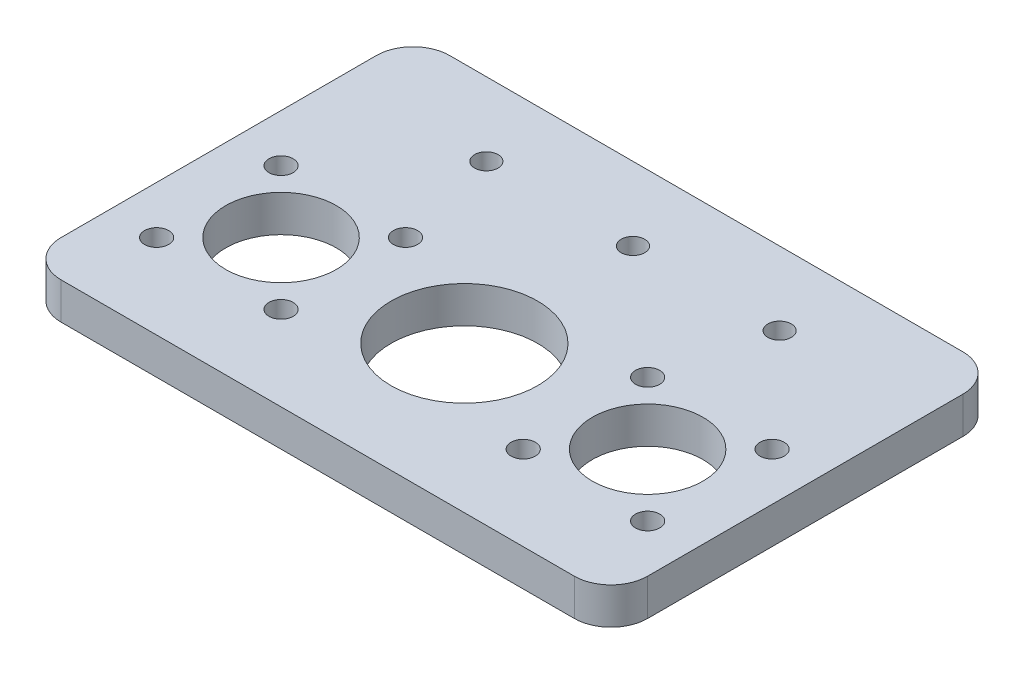
ISO-10303-21;
HEADER;
FILE_DESCRIPTION(('STEP AP214'),'2;1');
FILE_NAME('part.step','',(''),(''),'','','');
FILE_SCHEMA(('AUTOMOTIVE_DESIGN { 1 0 10303 214 1 1 1 1 }'));
ENDSEC;
DATA;
#1=APPLICATION_CONTEXT('core data for automotive mechanical design processes');
#2=APPLICATION_PROTOCOL_DEFINITION('international standard','automotive_design',2000,#1);
#3=PRODUCT_CONTEXT('',#1,'mechanical');
#4=PRODUCT('Part','Part','',(#3));
#5=PRODUCT_RELATED_PRODUCT_CATEGORY('part','',(#4));
#6=PRODUCT_DEFINITION_FORMATION('','',#4);
#7=PRODUCT_DEFINITION_CONTEXT('part definition',#1,'design');
#8=PRODUCT_DEFINITION('design','',#6,#7);
#9=PRODUCT_DEFINITION_SHAPE('','',#8);
#10=(LENGTH_UNIT() NAMED_UNIT(*) SI_UNIT(.MILLI.,.METRE.));
#11=(NAMED_UNIT(*) PLANE_ANGLE_UNIT() SI_UNIT($,.RADIAN.));
#12=(NAMED_UNIT(*) SI_UNIT($,.STERADIAN.) SOLID_ANGLE_UNIT());
#13=UNCERTAINTY_MEASURE_WITH_UNIT(LENGTH_MEASURE(1.E-05),#10,'distance_accuracy_value','');
#14=(GEOMETRIC_REPRESENTATION_CONTEXT(3) GLOBAL_UNCERTAINTY_ASSIGNED_CONTEXT((#13)) GLOBAL_UNIT_ASSIGNED_CONTEXT((#10,
#11,#12)) REPRESENTATION_CONTEXT('',''));
#15=CARTESIAN_POINT('',(0.,0.,0.));
#16=DIRECTION('',(0.,0.,1.));
#17=DIRECTION('',(1.,0.,0.));
#18=AXIS2_PLACEMENT_3D('',#15,#16,#17);
#19=CARTESIAN_POINT('',(0.,5.,-33.));
#20=DIRECTION('',(0.,0.,-1.));
#21=DIRECTION('',(-1.,0.,0.));
#22=AXIS2_PLACEMENT_3D('',#19,#20,#21);
#23=PLANE('',#22);
#24=DIRECTION('',(1.,0.,0.));
#25=VECTOR('',#24,1.);
#26=CARTESIAN_POINT('',(0.,0.,-33.));
#27=LINE('',#26,#25);
#28=CARTESIAN_POINT('',(-35.,0.,-33.));
#29=VERTEX_POINT('',#28);
#30=CARTESIAN_POINT('',(35.,0.,-33.));
#31=VERTEX_POINT('',#30);
#32=EDGE_CURVE('E173',#29,#31,#27,.T.);
#33=ORIENTED_EDGE('',*,*,#32,.F.);
#34=DIRECTION('',(0.,-1.,0.));
#35=VECTOR('',#34,1.);
#36=CARTESIAN_POINT('',(-35.,5.,-33.));
#37=LINE('',#36,#35);
#38=CARTESIAN_POINT('',(-35.,5.,-33.));
#39=VERTEX_POINT('',#38);
#40=EDGE_CURVE('E11',#39,#29,#37,.T.);
#41=ORIENTED_EDGE('',*,*,#40,.F.);
#42=DIRECTION('',(1.,0.,0.));
#43=VECTOR('',#42,1.);
#44=CARTESIAN_POINT('',(0.,5.,-33.));
#45=LINE('',#44,#43);
#46=CARTESIAN_POINT('',(35.,5.,-33.));
#47=VERTEX_POINT('',#46);
#48=EDGE_CURVE('E495',#39,#47,#45,.T.);
#49=ORIENTED_EDGE('',*,*,#48,.T.);
#50=DIRECTION('',(0.,-1.,0.));
#51=VECTOR('',#50,1.);
#52=CARTESIAN_POINT('',(35.,5.,-33.));
#53=LINE('',#52,#51);
#54=EDGE_CURVE('E88',#47,#31,#53,.T.);
#55=ORIENTED_EDGE('',*,*,#54,.T.);
#56=EDGE_LOOP('',(#33,#41,#49,#55));
#57=FACE_BOUND('',#56,.T.);
#58=ADVANCED_FACE('F37',(#57),#23,.T.);
#59=CARTESIAN_POINT('',(-35.,5.,-28.));
#60=DIRECTION('',(0.,-1.,0.));
#61=DIRECTION('',(0.,0.,-1.));
#62=AXIS2_PLACEMENT_3D('',#59,#60,#61);
#63=CYLINDRICAL_SURFACE('',#62,5.);
#64=CARTESIAN_POINT('',(-35.,0.,-28.));
#65=DIRECTION('',(0.,1.,0.));
#66=DIRECTION('',(0.,0.,1.));
#67=AXIS2_PLACEMENT_3D('',#64,#65,#66);
#68=CIRCLE('',#67,5.);
#69=CARTESIAN_POINT('',(-40.,0.,-28.));
#70=VERTEX_POINT('',#69);
#71=EDGE_CURVE('E176',#29,#70,#68,.T.);
#72=ORIENTED_EDGE('',*,*,#71,.T.);
#73=DIRECTION('',(0.,-1.,0.));
#74=VECTOR('',#73,1.);
#75=CARTESIAN_POINT('',(-40.,5.,-28.));
#76=LINE('',#75,#74);
#77=CARTESIAN_POINT('',(-40.,5.,-28.));
#78=VERTEX_POINT('',#77);
#79=EDGE_CURVE('E46',#78,#70,#76,.T.);
#80=ORIENTED_EDGE('',*,*,#79,.F.);
#81=CARTESIAN_POINT('',(-35.,5.,-28.));
#82=DIRECTION('',(0.,1.,0.));
#83=DIRECTION('',(0.,0.,1.));
#84=AXIS2_PLACEMENT_3D('',#81,#82,#83);
#85=CIRCLE('',#84,5.);
#86=EDGE_CURVE('E491',#39,#78,#85,.T.);
#87=ORIENTED_EDGE('',*,*,#86,.F.);
#88=ORIENTED_EDGE('',*,*,#40,.T.);
#89=EDGE_LOOP('',(#72,#80,#87,#88));
#90=FACE_BOUND('',#89,.T.);
#91=ADVANCED_FACE('F212',(#90),#63,.T.);
#92=CARTESIAN_POINT('',(-40.,5.,0.));
#93=DIRECTION('',(1.,0.,0.));
#94=DIRECTION('',(0.,0.,-1.));
#95=AXIS2_PLACEMENT_3D('',#92,#93,#94);
#96=PLANE('',#95);
#97=DIRECTION('',(0.,0.,1.));
#98=VECTOR('',#97,1.);
#99=CARTESIAN_POINT('',(-40.,0.,0.));
#100=LINE('',#99,#98);
#101=CARTESIAN_POINT('',(-40.,0.,15.));
#102=VERTEX_POINT('',#101);
#103=EDGE_CURVE('E179',#70,#102,#100,.T.);
#104=ORIENTED_EDGE('',*,*,#103,.T.);
#105=DIRECTION('',(0.,-1.,0.));
#106=VECTOR('',#105,1.);
#107=CARTESIAN_POINT('',(-40.,5.,15.));
#108=LINE('',#107,#106);
#109=CARTESIAN_POINT('',(-40.,5.,15.));
#110=VERTEX_POINT('',#109);
#111=EDGE_CURVE('E200',#110,#102,#108,.T.);
#112=ORIENTED_EDGE('',*,*,#111,.F.);
#113=DIRECTION('',(0.,0.,1.));
#114=VECTOR('',#113,1.);
#115=CARTESIAN_POINT('',(-40.,5.,0.));
#116=LINE('',#115,#114);
#117=EDGE_CURVE('E208',#78,#110,#116,.T.);
#118=ORIENTED_EDGE('',*,*,#117,.F.);
#119=ORIENTED_EDGE('',*,*,#79,.T.);
#120=EDGE_LOOP('',(#104,#112,#118,#119));
#121=FACE_BOUND('',#120,.T.);
#122=ADVANCED_FACE('F205',(#121),#96,.F.);
#123=CARTESIAN_POINT('',(-35.,5.,15.));
#124=DIRECTION('',(0.,-1.,0.));
#125=DIRECTION('',(0.,0.,-1.));
#126=AXIS2_PLACEMENT_3D('',#123,#124,#125);
#127=CYLINDRICAL_SURFACE('',#126,5.);
#128=CARTESIAN_POINT('',(-35.,0.,15.));
#129=DIRECTION('',(0.,1.,0.));
#130=DIRECTION('',(0.,0.,1.));
#131=AXIS2_PLACEMENT_3D('',#128,#129,#130);
#132=CIRCLE('',#131,5.);
#133=CARTESIAN_POINT('',(-35.,0.,20.));
#134=VERTEX_POINT('',#133);
#135=EDGE_CURVE('E182',#102,#134,#132,.T.);
#136=ORIENTED_EDGE('',*,*,#135,.T.);
#137=DIRECTION('',(0.,-1.,0.));
#138=VECTOR('',#137,1.);
#139=CARTESIAN_POINT('',(-35.,5.,20.));
#140=LINE('',#139,#138);
#141=CARTESIAN_POINT('',(-35.,5.,20.));
#142=VERTEX_POINT('',#141);
#143=EDGE_CURVE('E197',#142,#134,#140,.T.);
#144=ORIENTED_EDGE('',*,*,#143,.F.);
#145=CARTESIAN_POINT('',(-35.,5.,15.));
#146=DIRECTION('',(0.,1.,0.));
#147=DIRECTION('',(0.,0.,1.));
#148=AXIS2_PLACEMENT_3D('',#145,#146,#147);
#149=CIRCLE('',#148,5.);
#150=EDGE_CURVE('E489',#110,#142,#149,.T.);
#151=ORIENTED_EDGE('',*,*,#150,.F.);
#152=ORIENTED_EDGE('',*,*,#111,.T.);
#153=EDGE_LOOP('',(#136,#144,#151,#152));
#154=FACE_BOUND('',#153,.T.);
#155=ADVANCED_FACE('F339',(#154),#127,.T.);
#156=CARTESIAN_POINT('',(0.,5.,20.));
#157=DIRECTION('',(0.,0.,-1.));
#158=DIRECTION('',(-1.,0.,0.));
#159=AXIS2_PLACEMENT_3D('',#156,#157,#158);
#160=PLANE('',#159);
#161=DIRECTION('',(1.,0.,0.));
#162=VECTOR('',#161,1.);
#163=CARTESIAN_POINT('',(0.,0.,20.));
#164=LINE('',#163,#162);
#165=CARTESIAN_POINT('',(35.,0.,20.));
#166=VERTEX_POINT('',#165);
#167=EDGE_CURVE('E185',#134,#166,#164,.T.);
#168=ORIENTED_EDGE('',*,*,#167,.T.);
#169=DIRECTION('',(0.,-1.,0.));
#170=VECTOR('',#169,1.);
#171=CARTESIAN_POINT('',(35.,5.,20.));
#172=LINE('',#171,#170);
#173=CARTESIAN_POINT('',(35.,5.,20.));
#174=VERTEX_POINT('',#173);
#175=EDGE_CURVE('E124',#174,#166,#172,.T.);
#176=ORIENTED_EDGE('',*,*,#175,.F.);
#177=DIRECTION('',(1.,0.,0.));
#178=VECTOR('',#177,1.);
#179=CARTESIAN_POINT('',(0.,5.,20.));
#180=LINE('',#179,#178);
#181=EDGE_CURVE('E112',#142,#174,#180,.T.);
#182=ORIENTED_EDGE('',*,*,#181,.F.);
#183=ORIENTED_EDGE('',*,*,#143,.T.);
#184=EDGE_LOOP('',(#168,#176,#182,#183));
#185=FACE_BOUND('',#184,.T.);
#186=ADVANCED_FACE('F336',(#185),#160,.F.);
#187=CARTESIAN_POINT('',(35.,5.,15.));
#188=DIRECTION('',(0.,-1.,0.));
#189=DIRECTION('',(0.,0.,-1.));
#190=AXIS2_PLACEMENT_3D('',#187,#188,#189);
#191=CYLINDRICAL_SURFACE('',#190,5.);
#192=CARTESIAN_POINT('',(35.,0.,15.));
#193=DIRECTION('',(0.,1.,0.));
#194=DIRECTION('',(0.,0.,1.));
#195=AXIS2_PLACEMENT_3D('',#192,#193,#194);
#196=CIRCLE('',#195,5.);
#197=CARTESIAN_POINT('',(40.,0.,15.));
#198=VERTEX_POINT('',#197);
#199=EDGE_CURVE('E120',#166,#198,#196,.T.);
#200=ORIENTED_EDGE('',*,*,#199,.T.);
#201=DIRECTION('',(0.,-1.,0.));
#202=VECTOR('',#201,1.);
#203=CARTESIAN_POINT('',(40.,5.,15.));
#204=LINE('',#203,#202);
#205=CARTESIAN_POINT('',(40.,5.,15.));
#206=VERTEX_POINT('',#205);
#207=EDGE_CURVE('E118',#206,#198,#204,.T.);
#208=ORIENTED_EDGE('',*,*,#207,.F.);
#209=CARTESIAN_POINT('',(35.,5.,15.));
#210=DIRECTION('',(0.,1.,0.));
#211=DIRECTION('',(0.,0.,1.));
#212=AXIS2_PLACEMENT_3D('',#209,#210,#211);
#213=CIRCLE('',#212,5.);
#214=EDGE_CURVE('E106',#174,#206,#213,.T.);
#215=ORIENTED_EDGE('',*,*,#214,.F.);
#216=ORIENTED_EDGE('',*,*,#175,.T.);
#217=EDGE_LOOP('',(#200,#208,#215,#216));
#218=FACE_BOUND('',#217,.T.);
#219=ADVANCED_FACE('F119',(#218),#191,.T.);
#220=CARTESIAN_POINT('',(40.,5.,0.));
#221=DIRECTION('',(1.,0.,0.));
#222=DIRECTION('',(0.,0.,-1.));
#223=AXIS2_PLACEMENT_3D('',#220,#221,#222);
#224=PLANE('',#223);
#225=DIRECTION('',(0.,0.,1.));
#226=VECTOR('',#225,1.);
#227=CARTESIAN_POINT('',(40.,0.,0.));
#228=LINE('',#227,#226);
#229=CARTESIAN_POINT('',(40.,0.,-28.));
#230=VERTEX_POINT('',#229);
#231=EDGE_CURVE('E189',#230,#198,#228,.T.);
#232=ORIENTED_EDGE('',*,*,#231,.F.);
#233=DIRECTION('',(0.,-1.,0.));
#234=VECTOR('',#233,1.);
#235=CARTESIAN_POINT('',(40.,5.,-28.));
#236=LINE('',#235,#234);
#237=CARTESIAN_POINT('',(40.,5.,-28.));
#238=VERTEX_POINT('',#237);
#239=EDGE_CURVE('E81',#238,#230,#236,.T.);
#240=ORIENTED_EDGE('',*,*,#239,.F.);
#241=DIRECTION('',(0.,0.,1.));
#242=VECTOR('',#241,1.);
#243=CARTESIAN_POINT('',(40.,5.,0.));
#244=LINE('',#243,#242);
#245=EDGE_CURVE('E110',#238,#206,#244,.T.);
#246=ORIENTED_EDGE('',*,*,#245,.T.);
#247=ORIENTED_EDGE('',*,*,#207,.T.);
#248=EDGE_LOOP('',(#232,#240,#246,#247));
#249=FACE_BOUND('',#248,.T.);
#250=ADVANCED_FACE('F126',(#249),#224,.T.);
#251=CARTESIAN_POINT('',(20.,5.,-23.));
#252=DIRECTION('',(0.,-1.,0.));
#253=DIRECTION('',(0.,0.,-1.));
#254=AXIS2_PLACEMENT_3D('',#251,#252,#253);
#255=CYLINDRICAL_SURFACE('',#254,1.6);
#256=CARTESIAN_POINT('',(20.,5.,-23.));
#257=DIRECTION('',(0.,1.,0.));
#258=DIRECTION('',(0.,0.,1.));
#259=AXIS2_PLACEMENT_3D('',#256,#257,#258);
#260=CIRCLE('',#259,1.6);
#261=CARTESIAN_POINT('',(20.,5.,-21.4));
#262=VERTEX_POINT('',#261);
#263=EDGE_CURVE('E497',#262,#262,#260,.T.);
#264=ORIENTED_EDGE('',*,*,#263,.T.);
#265=EDGE_LOOP('',(#264));
#266=FACE_BOUND('',#265,.T.);
#267=CARTESIAN_POINT('',(20.,0.,-23.));
#268=DIRECTION('',(0.,1.,0.));
#269=DIRECTION('',(0.,0.,1.));
#270=AXIS2_PLACEMENT_3D('',#267,#268,#269);
#271=CIRCLE('',#270,1.6);
#272=CARTESIAN_POINT('',(20.,0.,-21.4));
#273=VERTEX_POINT('',#272);
#274=EDGE_CURVE('E170',#273,#273,#271,.T.);
#275=ORIENTED_EDGE('',*,*,#274,.F.);
#276=EDGE_LOOP('',(#275));
#277=FACE_BOUND('',#276,.T.);
#278=ADVANCED_FACE('F223',(#266,#277),#255,.F.);
#279=CARTESIAN_POINT('',(0.,5.,-23.));
#280=DIRECTION('',(0.,-1.,0.));
#281=DIRECTION('',(0.,0.,-1.));
#282=AXIS2_PLACEMENT_3D('',#279,#280,#281);
#283=CYLINDRICAL_SURFACE('',#282,1.6);
#284=CARTESIAN_POINT('',(0.,5.,-23.));
#285=DIRECTION('',(0.,1.,0.));
#286=DIRECTION('',(0.,0.,1.));
#287=AXIS2_PLACEMENT_3D('',#284,#285,#286);
#288=CIRCLE('',#287,1.6);
#289=CARTESIAN_POINT('',(0.,5.,-21.4));
#290=VERTEX_POINT('',#289);
#291=EDGE_CURVE('E500',#290,#290,#288,.T.);
#292=ORIENTED_EDGE('',*,*,#291,.T.);
#293=EDGE_LOOP('',(#292));
#294=FACE_BOUND('',#293,.T.);
#295=CARTESIAN_POINT('',(0.,0.,-23.));
#296=DIRECTION('',(0.,1.,0.));
#297=DIRECTION('',(0.,0.,1.));
#298=AXIS2_PLACEMENT_3D('',#295,#296,#297);
#299=CIRCLE('',#298,1.6);
#300=CARTESIAN_POINT('',(0.,0.,-21.4));
#301=VERTEX_POINT('',#300);
#302=EDGE_CURVE('E167',#301,#301,#299,.T.);
#303=ORIENTED_EDGE('',*,*,#302,.F.);
#304=EDGE_LOOP('',(#303));
#305=FACE_BOUND('',#304,.T.);
#306=ADVANCED_FACE('F226',(#294,#305),#283,.F.);
#307=CARTESIAN_POINT('',(-20.,5.,-23.));
#308=DIRECTION('',(0.,-1.,0.));
#309=DIRECTION('',(0.,0.,-1.));
#310=AXIS2_PLACEMENT_3D('',#307,#308,#309);
#311=CYLINDRICAL_SURFACE('',#310,1.6);
#312=CARTESIAN_POINT('',(-20.,5.,-23.));
#313=DIRECTION('',(0.,1.,0.));
#314=DIRECTION('',(0.,0.,1.));
#315=AXIS2_PLACEMENT_3D('',#312,#313,#314);
#316=CIRCLE('',#315,1.6);
#317=CARTESIAN_POINT('',(-20.,5.,-21.4));
#318=VERTEX_POINT('',#317);
#319=EDGE_CURVE('E503',#318,#318,#316,.T.);
#320=ORIENTED_EDGE('',*,*,#319,.T.);
#321=EDGE_LOOP('',(#320));
#322=FACE_BOUND('',#321,.T.);
#323=CARTESIAN_POINT('',(-20.,0.,-23.));
#324=DIRECTION('',(0.,1.,0.));
#325=DIRECTION('',(0.,0.,1.));
#326=AXIS2_PLACEMENT_3D('',#323,#324,#325);
#327=CIRCLE('',#326,1.6);
#328=CARTESIAN_POINT('',(-20.,0.,-21.4));
#329=VERTEX_POINT('',#328);
#330=EDGE_CURVE('E164',#329,#329,#327,.T.);
#331=ORIENTED_EDGE('',*,*,#330,.F.);
#332=EDGE_LOOP('',(#331));
#333=FACE_BOUND('',#332,.T.);
#334=ADVANCED_FACE('F230',(#322,#333),#311,.F.);
#335=CARTESIAN_POINT('',(33.4852813742385,5.,8.48528137423861));
#336=DIRECTION('',(0.,-1.,0.));
#337=DIRECTION('',(0.,0.,-1.));
#338=AXIS2_PLACEMENT_3D('',#335,#336,#337);
#339=CYLINDRICAL_SURFACE('',#338,1.65);
#340=CARTESIAN_POINT('',(33.4852813742385,5.,8.48528137423861));
#341=DIRECTION('',(0.,1.,0.));
#342=DIRECTION('',(0.,0.,1.));
#343=AXIS2_PLACEMENT_3D('',#340,#341,#342);
#344=CIRCLE('',#343,1.65);
#345=CARTESIAN_POINT('',(33.4852813742385,5.,10.1352813742386));
#346=VERTEX_POINT('',#345);
#347=EDGE_CURVE('E506',#346,#346,#344,.F.);
#348=ORIENTED_EDGE('',*,*,#347,.F.);
#349=EDGE_LOOP('',(#348));
#350=FACE_BOUND('',#349,.T.);
#351=CARTESIAN_POINT('',(33.4852813742385,0.,8.48528137423861));
#352=DIRECTION('',(0.,1.,0.));
#353=DIRECTION('',(0.,0.,1.));
#354=AXIS2_PLACEMENT_3D('',#351,#352,#353);
#355=CIRCLE('',#354,1.65);
#356=CARTESIAN_POINT('',(33.4852813742385,0.,10.1352813742386));
#357=VERTEX_POINT('',#356);
#358=EDGE_CURVE('E161',#357,#357,#355,.F.);
#359=ORIENTED_EDGE('',*,*,#358,.T.);
#360=EDGE_LOOP('',(#359));
#361=FACE_BOUND('',#360,.T.);
#362=ADVANCED_FACE('F234',(#350,#361),#339,.F.);
#363=CARTESIAN_POINT('',(16.5147186257615,5.,-8.48528137423862));
#364=DIRECTION('',(0.,-1.,0.));
#365=DIRECTION('',(0.,0.,-1.));
#366=AXIS2_PLACEMENT_3D('',#363,#364,#365);
#367=CYLINDRICAL_SURFACE('',#366,1.65);
#368=CARTESIAN_POINT('',(16.5147186257615,5.,-8.48528137423862));
#369=DIRECTION('',(0.,1.,0.));
#370=DIRECTION('',(0.,0.,1.));
#371=AXIS2_PLACEMENT_3D('',#368,#369,#370);
#372=CIRCLE('',#371,1.65);
#373=CARTESIAN_POINT('',(16.5147186257615,5.,-6.83528137423862));
#374=VERTEX_POINT('',#373);
#375=EDGE_CURVE('E509',#374,#374,#372,.F.);
#376=ORIENTED_EDGE('',*,*,#375,.F.);
#377=EDGE_LOOP('',(#376));
#378=FACE_BOUND('',#377,.T.);
#379=CARTESIAN_POINT('',(16.5147186257615,0.,-8.48528137423862));
#380=DIRECTION('',(0.,1.,0.));
#381=DIRECTION('',(0.,0.,1.));
#382=AXIS2_PLACEMENT_3D('',#379,#380,#381);
#383=CIRCLE('',#382,1.65);
#384=CARTESIAN_POINT('',(16.5147186257615,0.,-6.83528137423862));
#385=VERTEX_POINT('',#384);
#386=EDGE_CURVE('E158',#385,#385,#383,.F.);
#387=ORIENTED_EDGE('',*,*,#386,.T.);
#388=EDGE_LOOP('',(#387));
#389=FACE_BOUND('',#388,.T.);
#390=ADVANCED_FACE('F238',(#378,#389),#367,.F.);
#391=CARTESIAN_POINT('',(0.,5.,0.));
#392=DIRECTION('',(0.,-1.,0.));
#393=DIRECTION('',(0.,0.,-1.));
#394=AXIS2_PLACEMENT_3D('',#391,#392,#393);
#395=CYLINDRICAL_SURFACE('',#394,10.);
#396=CARTESIAN_POINT('',(0.,5.,0.));
#397=DIRECTION('',(0.,1.,0.));
#398=DIRECTION('',(0.,0.,1.));
#399=AXIS2_PLACEMENT_3D('',#396,#397,#398);
#400=CIRCLE('',#399,10.);
#401=CARTESIAN_POINT('',(0.,5.,10.));
#402=VERTEX_POINT('',#401);
#403=EDGE_CURVE('E512',#402,#402,#400,.T.);
#404=ORIENTED_EDGE('',*,*,#403,.T.);
#405=EDGE_LOOP('',(#404));
#406=FACE_BOUND('',#405,.T.);
#407=CARTESIAN_POINT('',(0.,0.,0.));
#408=DIRECTION('',(0.,1.,0.));
#409=DIRECTION('',(0.,0.,1.));
#410=AXIS2_PLACEMENT_3D('',#407,#408,#409);
#411=CIRCLE('',#410,10.);
#412=CARTESIAN_POINT('',(0.,0.,10.));
#413=VERTEX_POINT('',#412);
#414=EDGE_CURVE('E155',#413,#413,#411,.T.);
#415=ORIENTED_EDGE('',*,*,#414,.F.);
#416=EDGE_LOOP('',(#415));
#417=FACE_BOUND('',#416,.T.);
#418=ADVANCED_FACE('F242',(#406,#417),#395,.F.);
#419=CARTESIAN_POINT('',(-25.,5.,0.));
#420=DIRECTION('',(0.,-1.,0.));
#421=DIRECTION('',(0.,0.,-1.));
#422=AXIS2_PLACEMENT_3D('',#419,#420,#421);
#423=CYLINDRICAL_SURFACE('',#422,7.55);
#424=CARTESIAN_POINT('',(-25.,5.,0.));
#425=DIRECTION('',(0.,1.,0.));
#426=DIRECTION('',(0.,0.,1.));
#427=AXIS2_PLACEMENT_3D('',#424,#425,#426);
#428=CIRCLE('',#427,7.55);
#429=CARTESIAN_POINT('',(-25.,5.,7.55));
#430=VERTEX_POINT('',#429);
#431=EDGE_CURVE('E515',#430,#430,#428,.T.);
#432=ORIENTED_EDGE('',*,*,#431,.T.);
#433=EDGE_LOOP('',(#432));
#434=FACE_BOUND('',#433,.T.);
#435=CARTESIAN_POINT('',(-25.,0.,0.));
#436=DIRECTION('',(0.,1.,0.));
#437=DIRECTION('',(0.,0.,1.));
#438=AXIS2_PLACEMENT_3D('',#435,#436,#437);
#439=CIRCLE('',#438,7.55);
#440=CARTESIAN_POINT('',(-25.,0.,7.55));
#441=VERTEX_POINT('',#440);
#442=EDGE_CURVE('E152',#441,#441,#439,.T.);
#443=ORIENTED_EDGE('',*,*,#442,.F.);
#444=EDGE_LOOP('',(#443));
#445=FACE_BOUND('',#444,.T.);
#446=ADVANCED_FACE('F246',(#434,#445),#423,.F.);
#447=CARTESIAN_POINT('',(-33.4852813742386,5.,-8.48528137423853));
#448=DIRECTION('',(0.,-1.,0.));
#449=DIRECTION('',(0.,0.,-1.));
#450=AXIS2_PLACEMENT_3D('',#447,#448,#449);
#451=CYLINDRICAL_SURFACE('',#450,1.65);
#452=CARTESIAN_POINT('',(-33.4852813742386,5.,-8.48528137423853));
#453=DIRECTION('',(0.,1.,0.));
#454=DIRECTION('',(0.,0.,1.));
#455=AXIS2_PLACEMENT_3D('',#452,#453,#454);
#456=CIRCLE('',#455,1.65);
#457=CARTESIAN_POINT('',(-33.4852813742386,5.,-6.83528137423853));
#458=VERTEX_POINT('',#457);
#459=EDGE_CURVE('E518',#458,#458,#456,.T.);
#460=ORIENTED_EDGE('',*,*,#459,.T.);
#461=EDGE_LOOP('',(#460));
#462=FACE_BOUND('',#461,.T.);
#463=CARTESIAN_POINT('',(-33.4852813742386,0.,-8.48528137423853));
#464=DIRECTION('',(0.,1.,0.));
#465=DIRECTION('',(0.,0.,1.));
#466=AXIS2_PLACEMENT_3D('',#463,#464,#465);
#467=CIRCLE('',#466,1.65);
#468=CARTESIAN_POINT('',(-33.4852813742386,0.,-6.83528137423853));
#469=VERTEX_POINT('',#468);
#470=EDGE_CURVE('E149',#469,#469,#467,.T.);
#471=ORIENTED_EDGE('',*,*,#470,.F.);
#472=EDGE_LOOP('',(#471));
#473=FACE_BOUND('',#472,.T.);
#474=ADVANCED_FACE('F250',(#462,#473),#451,.F.);
#475=CARTESIAN_POINT('',(-16.5147186257615,5.,-8.48528137423862));
#476=DIRECTION('',(0.,-1.,0.));
#477=DIRECTION('',(0.,0.,-1.));
#478=AXIS2_PLACEMENT_3D('',#475,#476,#477);
#479=CYLINDRICAL_SURFACE('',#478,1.65);
#480=CARTESIAN_POINT('',(-16.5147186257615,5.,-8.48528137423862));
#481=DIRECTION('',(0.,1.,0.));
#482=DIRECTION('',(0.,0.,1.));
#483=AXIS2_PLACEMENT_3D('',#480,#481,#482);
#484=CIRCLE('',#483,1.65);
#485=CARTESIAN_POINT('',(-16.5147186257615,5.,-6.83528137423862));
#486=VERTEX_POINT('',#485);
#487=EDGE_CURVE('E521',#486,#486,#484,.T.);
#488=ORIENTED_EDGE('',*,*,#487,.T.);
#489=EDGE_LOOP('',(#488));
#490=FACE_BOUND('',#489,.T.);
#491=CARTESIAN_POINT('',(-16.5147186257615,0.,-8.48528137423862));
#492=DIRECTION('',(0.,1.,0.));
#493=DIRECTION('',(0.,0.,1.));
#494=AXIS2_PLACEMENT_3D('',#491,#492,#493);
#495=CIRCLE('',#494,1.65);
#496=CARTESIAN_POINT('',(-16.5147186257615,0.,-6.83528137423862));
#497=VERTEX_POINT('',#496);
#498=EDGE_CURVE('E146',#497,#497,#495,.T.);
#499=ORIENTED_EDGE('',*,*,#498,.F.);
#500=EDGE_LOOP('',(#499));
#501=FACE_BOUND('',#500,.T.);
#502=ADVANCED_FACE('F254',(#490,#501),#479,.F.);
#503=CARTESIAN_POINT('',(-16.5147186257614,5.,8.48528137423852));
#504=DIRECTION('',(0.,-1.,0.));
#505=DIRECTION('',(0.,0.,-1.));
#506=AXIS2_PLACEMENT_3D('',#503,#504,#505);
#507=CYLINDRICAL_SURFACE('',#506,1.64999999999999);
#508=CARTESIAN_POINT('',(-16.5147186257614,5.,8.48528137423852));
#509=DIRECTION('',(0.,1.,0.));
#510=DIRECTION('',(0.,0.,1.));
#511=AXIS2_PLACEMENT_3D('',#508,#509,#510);
#512=CIRCLE('',#511,1.64999999999999);
#513=CARTESIAN_POINT('',(-16.5147186257614,5.,10.1352813742385));
#514=VERTEX_POINT('',#513);
#515=EDGE_CURVE('E524',#514,#514,#512,.T.);
#516=ORIENTED_EDGE('',*,*,#515,.T.);
#517=EDGE_LOOP('',(#516));
#518=FACE_BOUND('',#517,.T.);
#519=CARTESIAN_POINT('',(-16.5147186257614,0.,8.48528137423852));
#520=DIRECTION('',(0.,1.,0.));
#521=DIRECTION('',(0.,0.,1.));
#522=AXIS2_PLACEMENT_3D('',#519,#520,#521);
#523=CIRCLE('',#522,1.64999999999999);
#524=CARTESIAN_POINT('',(-16.5147186257614,0.,10.1352813742385));
#525=VERTEX_POINT('',#524);
#526=EDGE_CURVE('E143',#525,#525,#523,.T.);
#527=ORIENTED_EDGE('',*,*,#526,.F.);
#528=EDGE_LOOP('',(#527));
#529=FACE_BOUND('',#528,.T.);
#530=ADVANCED_FACE('F258',(#518,#529),#507,.F.);
#531=CARTESIAN_POINT('',(-33.4852813742385,5.,8.48528137423861));
#532=DIRECTION('',(0.,-1.,0.));
#533=DIRECTION('',(0.,0.,-1.));
#534=AXIS2_PLACEMENT_3D('',#531,#532,#533);
#535=CYLINDRICAL_SURFACE('',#534,1.65);
#536=CARTESIAN_POINT('',(-33.4852813742385,5.,8.48528137423861));
#537=DIRECTION('',(0.,1.,0.));
#538=DIRECTION('',(0.,0.,1.));
#539=AXIS2_PLACEMENT_3D('',#536,#537,#538);
#540=CIRCLE('',#539,1.65);
#541=CARTESIAN_POINT('',(-33.4852813742385,5.,10.1352813742386));
#542=VERTEX_POINT('',#541);
#543=EDGE_CURVE('E527',#542,#542,#540,.T.);
#544=ORIENTED_EDGE('',*,*,#543,.T.);
#545=EDGE_LOOP('',(#544));
#546=FACE_BOUND('',#545,.T.);
#547=CARTESIAN_POINT('',(-33.4852813742385,0.,8.48528137423861));
#548=DIRECTION('',(0.,1.,0.));
#549=DIRECTION('',(0.,0.,1.));
#550=AXIS2_PLACEMENT_3D('',#547,#548,#549);
#551=CIRCLE('',#550,1.65);
#552=CARTESIAN_POINT('',(-33.4852813742385,0.,10.1352813742386));
#553=VERTEX_POINT('',#552);
#554=EDGE_CURVE('E140',#553,#553,#551,.T.);
#555=ORIENTED_EDGE('',*,*,#554,.F.);
#556=EDGE_LOOP('',(#555));
#557=FACE_BOUND('',#556,.T.);
#558=ADVANCED_FACE('F262',(#546,#557),#535,.F.);
#559=CARTESIAN_POINT('',(25.,5.,0.));
#560=DIRECTION('',(0.,-1.,0.));
#561=DIRECTION('',(0.,0.,-1.));
#562=AXIS2_PLACEMENT_3D('',#559,#560,#561);
#563=CYLINDRICAL_SURFACE('',#562,7.55);
#564=CARTESIAN_POINT('',(25.,5.,0.));
#565=DIRECTION('',(0.,1.,0.));
#566=DIRECTION('',(0.,0.,1.));
#567=AXIS2_PLACEMENT_3D('',#564,#565,#566);
#568=CIRCLE('',#567,7.55);
#569=CARTESIAN_POINT('',(25.,5.,7.55));
#570=VERTEX_POINT('',#569);
#571=EDGE_CURVE('E530',#570,#570,#568,.F.);
#572=ORIENTED_EDGE('',*,*,#571,.F.);
#573=EDGE_LOOP('',(#572));
#574=FACE_BOUND('',#573,.T.);
#575=CARTESIAN_POINT('',(25.,0.,0.));
#576=DIRECTION('',(0.,1.,0.));
#577=DIRECTION('',(0.,0.,1.));
#578=AXIS2_PLACEMENT_3D('',#575,#576,#577);
#579=CIRCLE('',#578,7.55);
#580=CARTESIAN_POINT('',(25.,0.,7.55));
#581=VERTEX_POINT('',#580);
#582=EDGE_CURVE('E137',#581,#581,#579,.F.);
#583=ORIENTED_EDGE('',*,*,#582,.T.);
#584=EDGE_LOOP('',(#583));
#585=FACE_BOUND('',#584,.T.);
#586=ADVANCED_FACE('F266',(#574,#585),#563,.F.);
#587=CARTESIAN_POINT('',(16.5147186257614,5.,8.48528137423852));
#588=DIRECTION('',(0.,-1.,0.));
#589=DIRECTION('',(0.,0.,-1.));
#590=AXIS2_PLACEMENT_3D('',#587,#588,#589);
#591=CYLINDRICAL_SURFACE('',#590,1.64999999999999);
#592=CARTESIAN_POINT('',(16.5147186257614,5.,8.48528137423852));
#593=DIRECTION('',(0.,1.,0.));
#594=DIRECTION('',(0.,0.,1.));
#595=AXIS2_PLACEMENT_3D('',#592,#593,#594);
#596=CIRCLE('',#595,1.64999999999999);
#597=CARTESIAN_POINT('',(16.5147186257614,5.,10.1352813742385));
#598=VERTEX_POINT('',#597);
#599=EDGE_CURVE('E281',#598,#598,#596,.F.);
#600=ORIENTED_EDGE('',*,*,#599,.F.);
#601=EDGE_LOOP('',(#600));
#602=FACE_BOUND('',#601,.T.);
#603=CARTESIAN_POINT('',(16.5147186257614,0.,8.48528137423852));
#604=DIRECTION('',(0.,1.,0.));
#605=DIRECTION('',(0.,0.,1.));
#606=AXIS2_PLACEMENT_3D('',#603,#604,#605);
#607=CIRCLE('',#606,1.64999999999999);
#608=CARTESIAN_POINT('',(16.5147186257614,0.,10.1352813742385));
#609=VERTEX_POINT('',#608);
#610=EDGE_CURVE('E134',#609,#609,#607,.F.);
#611=ORIENTED_EDGE('',*,*,#610,.T.);
#612=EDGE_LOOP('',(#611));
#613=FACE_BOUND('',#612,.T.);
#614=ADVANCED_FACE('F269',(#602,#613),#591,.F.);
#615=CARTESIAN_POINT('',(33.4852813742386,5.,-8.48528137423854));
#616=DIRECTION('',(0.,-1.,0.));
#617=DIRECTION('',(0.,0.,-1.));
#618=AXIS2_PLACEMENT_3D('',#615,#616,#617);
#619=CYLINDRICAL_SURFACE('',#618,1.65);
#620=CARTESIAN_POINT('',(33.4852813742386,5.,-8.48528137423854));
#621=DIRECTION('',(0.,1.,0.));
#622=DIRECTION('',(0.,0.,1.));
#623=AXIS2_PLACEMENT_3D('',#620,#621,#622);
#624=CIRCLE('',#623,1.65);
#625=CARTESIAN_POINT('',(33.4852813742386,5.,-6.83528137423855));
#626=VERTEX_POINT('',#625);
#627=EDGE_CURVE('E193',#626,#626,#624,.F.);
#628=ORIENTED_EDGE('',*,*,#627,.F.);
#629=EDGE_LOOP('',(#628));
#630=FACE_BOUND('',#629,.T.);
#631=CARTESIAN_POINT('',(33.4852813742386,0.,-8.48528137423854));
#632=DIRECTION('',(0.,1.,0.));
#633=DIRECTION('',(0.,0.,1.));
#634=AXIS2_PLACEMENT_3D('',#631,#632,#633);
#635=CIRCLE('',#634,1.65);
#636=CARTESIAN_POINT('',(33.4852813742386,0.,-6.83528137423855));
#637=VERTEX_POINT('',#636);
#638=EDGE_CURVE('E131',#637,#637,#635,.F.);
#639=ORIENTED_EDGE('',*,*,#638,.T.);
#640=EDGE_LOOP('',(#639));
#641=FACE_BOUND('',#640,.T.);
#642=ADVANCED_FACE('F39',(#630,#641),#619,.F.);
#643=CARTESIAN_POINT('',(35.,5.,-28.));
#644=DIRECTION('',(0.,-1.,0.));
#645=DIRECTION('',(0.,0.,-1.));
#646=AXIS2_PLACEMENT_3D('',#643,#644,#645);
#647=CYLINDRICAL_SURFACE('',#646,5.);
#648=CARTESIAN_POINT('',(35.,0.,-28.));
#649=DIRECTION('',(0.,1.,0.));
#650=DIRECTION('',(0.,0.,1.));
#651=AXIS2_PLACEMENT_3D('',#648,#649,#650);
#652=CIRCLE('',#651,5.);
#653=EDGE_CURVE('E191',#230,#31,#652,.T.);
#654=ORIENTED_EDGE('',*,*,#653,.T.);
#655=ORIENTED_EDGE('',*,*,#54,.F.);
#656=CARTESIAN_POINT('',(35.,5.,-28.));
#657=DIRECTION('',(0.,1.,0.));
#658=DIRECTION('',(0.,0.,1.));
#659=AXIS2_PLACEMENT_3D('',#656,#657,#658);
#660=CIRCLE('',#659,5.);
#661=EDGE_CURVE('E54',#238,#47,#660,.T.);
#662=ORIENTED_EDGE('',*,*,#661,.F.);
#663=ORIENTED_EDGE('',*,*,#239,.T.);
#664=EDGE_LOOP('',(#654,#655,#662,#663));
#665=FACE_BOUND('',#664,.T.);
#666=ADVANCED_FACE('F276',(#665),#647,.T.);
#667=CARTESIAN_POINT('',(0.,5.,0.));
#668=DIRECTION('',(0.,1.,0.));
#669=DIRECTION('',(0.,0.,1.));
#670=AXIS2_PLACEMENT_3D('',#667,#668,#669);
#671=PLANE('',#670);
#672=ORIENTED_EDGE('',*,*,#627,.T.);
#673=EDGE_LOOP('',(#672));
#674=FACE_BOUND('',#673,.T.);
#675=ORIENTED_EDGE('',*,*,#599,.T.);
#676=EDGE_LOOP('',(#675));
#677=FACE_BOUND('',#676,.T.);
#678=ORIENTED_EDGE('',*,*,#571,.T.);
#679=EDGE_LOOP('',(#678));
#680=FACE_BOUND('',#679,.T.);
#681=ORIENTED_EDGE('',*,*,#543,.F.);
#682=EDGE_LOOP('',(#681));
#683=FACE_BOUND('',#682,.T.);
#684=ORIENTED_EDGE('',*,*,#515,.F.);
#685=EDGE_LOOP('',(#684));
#686=FACE_BOUND('',#685,.T.);
#687=ORIENTED_EDGE('',*,*,#487,.F.);
#688=EDGE_LOOP('',(#687));
#689=FACE_BOUND('',#688,.T.);
#690=ORIENTED_EDGE('',*,*,#459,.F.);
#691=EDGE_LOOP('',(#690));
#692=FACE_BOUND('',#691,.T.);
#693=ORIENTED_EDGE('',*,*,#431,.F.);
#694=EDGE_LOOP('',(#693));
#695=FACE_BOUND('',#694,.T.);
#696=ORIENTED_EDGE('',*,*,#403,.F.);
#697=EDGE_LOOP('',(#696));
#698=FACE_BOUND('',#697,.T.);
#699=ORIENTED_EDGE('',*,*,#375,.T.);
#700=EDGE_LOOP('',(#699));
#701=FACE_BOUND('',#700,.T.);
#702=ORIENTED_EDGE('',*,*,#347,.T.);
#703=EDGE_LOOP('',(#702));
#704=FACE_BOUND('',#703,.T.);
#705=ORIENTED_EDGE('',*,*,#319,.F.);
#706=EDGE_LOOP('',(#705));
#707=FACE_BOUND('',#706,.T.);
#708=ORIENTED_EDGE('',*,*,#291,.F.);
#709=EDGE_LOOP('',(#708));
#710=FACE_BOUND('',#709,.T.);
#711=ORIENTED_EDGE('',*,*,#263,.F.);
#712=EDGE_LOOP('',(#711));
#713=FACE_BOUND('',#712,.T.);
#714=ORIENTED_EDGE('',*,*,#48,.F.);
#715=ORIENTED_EDGE('',*,*,#86,.T.);
#716=ORIENTED_EDGE('',*,*,#117,.T.);
#717=ORIENTED_EDGE('',*,*,#150,.T.);
#718=ORIENTED_EDGE('',*,*,#181,.T.);
#719=ORIENTED_EDGE('',*,*,#214,.T.);
#720=ORIENTED_EDGE('',*,*,#245,.F.);
#721=ORIENTED_EDGE('',*,*,#661,.T.);
#722=EDGE_LOOP('',(#714,#715,#716,#717,#718,#719,#720,#721));
#723=FACE_BOUND('',#722,.T.);
#724=ADVANCED_FACE('F108',(#674,#677,#680,#683,#686,#689,#692,#695,#698,#701,#704,#707,#710,
#713,#723),#671,.T.);
#725=CARTESIAN_POINT('',(0.,0.,0.));
#726=DIRECTION('',(0.,1.,0.));
#727=DIRECTION('',(0.,0.,1.));
#728=AXIS2_PLACEMENT_3D('',#725,#726,#727);
#729=PLANE('',#728);
#730=ORIENTED_EDGE('',*,*,#638,.F.);
#731=EDGE_LOOP('',(#730));
#732=FACE_BOUND('',#731,.T.);
#733=ORIENTED_EDGE('',*,*,#610,.F.);
#734=EDGE_LOOP('',(#733));
#735=FACE_BOUND('',#734,.T.);
#736=ORIENTED_EDGE('',*,*,#582,.F.);
#737=EDGE_LOOP('',(#736));
#738=FACE_BOUND('',#737,.T.);
#739=ORIENTED_EDGE('',*,*,#554,.T.);
#740=EDGE_LOOP('',(#739));
#741=FACE_BOUND('',#740,.T.);
#742=ORIENTED_EDGE('',*,*,#526,.T.);
#743=EDGE_LOOP('',(#742));
#744=FACE_BOUND('',#743,.T.);
#745=ORIENTED_EDGE('',*,*,#498,.T.);
#746=EDGE_LOOP('',(#745));
#747=FACE_BOUND('',#746,.T.);
#748=ORIENTED_EDGE('',*,*,#470,.T.);
#749=EDGE_LOOP('',(#748));
#750=FACE_BOUND('',#749,.T.);
#751=ORIENTED_EDGE('',*,*,#442,.T.);
#752=EDGE_LOOP('',(#751));
#753=FACE_BOUND('',#752,.T.);
#754=ORIENTED_EDGE('',*,*,#414,.T.);
#755=EDGE_LOOP('',(#754));
#756=FACE_BOUND('',#755,.T.);
#757=ORIENTED_EDGE('',*,*,#386,.F.);
#758=EDGE_LOOP('',(#757));
#759=FACE_BOUND('',#758,.T.);
#760=ORIENTED_EDGE('',*,*,#358,.F.);
#761=EDGE_LOOP('',(#760));
#762=FACE_BOUND('',#761,.T.);
#763=ORIENTED_EDGE('',*,*,#330,.T.);
#764=EDGE_LOOP('',(#763));
#765=FACE_BOUND('',#764,.T.);
#766=ORIENTED_EDGE('',*,*,#302,.T.);
#767=EDGE_LOOP('',(#766));
#768=FACE_BOUND('',#767,.T.);
#769=ORIENTED_EDGE('',*,*,#274,.T.);
#770=EDGE_LOOP('',(#769));
#771=FACE_BOUND('',#770,.T.);
#772=ORIENTED_EDGE('',*,*,#32,.T.);
#773=ORIENTED_EDGE('',*,*,#653,.F.);
#774=ORIENTED_EDGE('',*,*,#231,.T.);
#775=ORIENTED_EDGE('',*,*,#199,.F.);
#776=ORIENTED_EDGE('',*,*,#167,.F.);
#777=ORIENTED_EDGE('',*,*,#135,.F.);
#778=ORIENTED_EDGE('',*,*,#103,.F.);
#779=ORIENTED_EDGE('',*,*,#71,.F.);
#780=EDGE_LOOP('',(#772,#773,#774,#775,#776,#777,#778,#779));
#781=FACE_BOUND('',#780,.T.);
#782=ADVANCED_FACE('F214',(#732,#735,#738,#741,#744,#747,#750,#753,#756,#759,#762,#765,#768,
#771,#781),#729,.F.);
#783=CLOSED_SHELL('',(#58,#91,#122,#155,#186,#219,#250,#278,#306,#334,#362,#390,#418,#446,#474,
#502,#530,#558,#586,#614,#642,#666,#724,#782));
#784=MANIFOLD_SOLID_BREP('B2',#783);
#785=ADVANCED_BREP_SHAPE_REPRESENTATION('',(#18,#784),#14);
#786=SHAPE_DEFINITION_REPRESENTATION(#9,#785);
ENDSEC;
END-ISO-10303-21;
